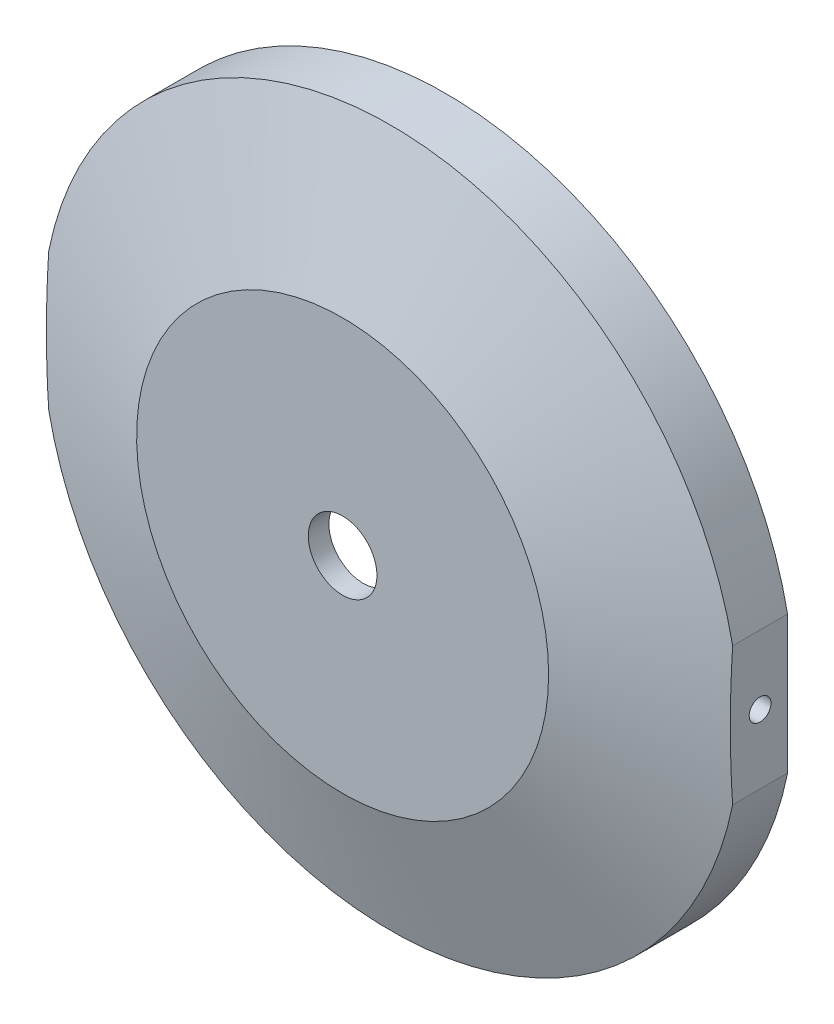
ISO-10303-21;
HEADER;
FILE_DESCRIPTION(('STEP AP214'),'2;1');
FILE_NAME('part.step','',(''),(''),'','','');
FILE_SCHEMA(('AUTOMOTIVE_DESIGN { 1 0 10303 214 1 1 1 1 }'));
ENDSEC;
DATA;
#1=APPLICATION_CONTEXT('core data for automotive mechanical design processes');
#2=APPLICATION_PROTOCOL_DEFINITION('international standard','automotive_design',2000,#1);
#3=PRODUCT_CONTEXT('',#1,'mechanical');
#4=PRODUCT('Part','Part','',(#3));
#5=PRODUCT_RELATED_PRODUCT_CATEGORY('part','',(#4));
#6=PRODUCT_DEFINITION_FORMATION('','',#4);
#7=PRODUCT_DEFINITION_CONTEXT('part definition',#1,'design');
#8=PRODUCT_DEFINITION('design','',#6,#7);
#9=PRODUCT_DEFINITION_SHAPE('','',#8);
#10=(LENGTH_UNIT() NAMED_UNIT(*) SI_UNIT(.MILLI.,.METRE.));
#11=(NAMED_UNIT(*) PLANE_ANGLE_UNIT() SI_UNIT($,.RADIAN.));
#12=(NAMED_UNIT(*) SI_UNIT($,.STERADIAN.) SOLID_ANGLE_UNIT());
#13=UNCERTAINTY_MEASURE_WITH_UNIT(LENGTH_MEASURE(1.E-05),#10,'distance_accuracy_value','');
#14=(GEOMETRIC_REPRESENTATION_CONTEXT(3) GLOBAL_UNCERTAINTY_ASSIGNED_CONTEXT((#13)) GLOBAL_UNIT_ASSIGNED_CONTEXT((#10,
#11,#12)) REPRESENTATION_CONTEXT('',''));
#15=CARTESIAN_POINT('',(0.,0.,0.));
#16=DIRECTION('',(0.,0.,1.));
#17=DIRECTION('',(1.,0.,0.));
#18=AXIS2_PLACEMENT_3D('',#15,#16,#17);
#19=CARTESIAN_POINT('',(-49.8,0.,0.));
#20=DIRECTION('',(1.,0.,0.));
#21=DIRECTION('',(0.,0.,1.));
#22=AXIS2_PLACEMENT_3D('',#19,#20,#21);
#23=PLANE('',#22);
#24=CARTESIAN_POINT('',(-49.8,-38.4617099714943,-11.0799606111375));
#25=CARTESIAN_POINT('',(-49.8,-37.1028634271938,-10.8004756503426));
#26=CARTESIAN_POINT('',(-49.8,-35.7421612624027,-10.5298064962957));
#27=CARTESIAN_POINT('',(-49.8,-33.0167625762512,-10.0087030148906));
#28=CARTESIAN_POINT('',(-49.8,-31.6520656935223,-9.75827058072604));
#29=CARTESIAN_POINT('',(-49.8,-28.9172889925232,-9.28005926574882));
#30=CARTESIAN_POINT('',(-49.8,-27.5472051703253,-9.0523031643991));
#31=CARTESIAN_POINT('',(-49.8,-24.8030093164406,-8.62262887703947));
#32=CARTESIAN_POINT('',(-49.8,-23.4288973847371,-8.42071005517551));
#33=CARTESIAN_POINT('',(-49.8,-20.6784717869354,-8.04592394670637));
#34=CARTESIAN_POINT('',(-49.8,-19.3021631243411,-7.87302013548836));
#35=CARTESIAN_POINT('',(-49.8,-16.5459073872997,-7.5588924160293));
#36=CARTESIAN_POINT('',(-49.8,-15.1659602964614,-7.417668650754));
#37=CARTESIAN_POINT('',(-49.8,-12.4034646218349,-7.16966287483199));
#38=CARTESIAN_POINT('',(-49.8,-11.0209171780662,-7.06286824870942));
#39=CARTESIAN_POINT('',(-49.8,-8.25346962181492,-6.8859203200606));
#40=CARTESIAN_POINT('',(-49.8,-6.86856952262751,-6.81576681115775));
#41=CARTESIAN_POINT('',(-49.8,-4.12180458675857,-6.71460368668181));
#42=CARTESIAN_POINT('',(-49.8,-2.75996452600506,-6.68292514818495));
#43=CARTESIAN_POINT('',(-49.8,-0.0359268590491195,-6.65720177420516));
#44=CARTESIAN_POINT('',(-49.8,1.32627074688356,-6.6631569104102));
#45=CARTESIAN_POINT('',(-49.8,4.05016431956752,-6.71256597927004));
#46=CARTESIAN_POINT('',(-49.8,5.41186019410504,-6.75602495975847));
#47=CARTESIAN_POINT('',(-49.8,8.13358342299819,-6.87945660113571));
#48=CARTESIAN_POINT('',(-49.8,9.49361077608038,-6.95942928987478));
#49=CARTESIAN_POINT('',(-49.8,12.2103226888578,-7.15409767239459));
#50=CARTESIAN_POINT('',(-49.8,13.5670087946878,-7.26877188277581));
#51=CARTESIAN_POINT('',(-49.8,16.2772138130531,-7.53056683958318));
#52=CARTESIAN_POINT('',(-49.8,17.630732702847,-7.6776878182677));
#53=CARTESIAN_POINT('',(-49.8,21.6856351084796,-8.16374002143987));
#54=CARTESIAN_POINT('',(-49.8,24.3817590338531,-8.54739025310277));
#55=CARTESIAN_POINT('',(-49.8,28.0213916738615,-9.13235604065327));
#56=CARTESIAN_POINT('',(-49.8,28.9720256030184,-9.29136935083275));
#57=CARTESIAN_POINT('',(-49.8,30.8711995955897,-9.62054500946501));
#58=CARTESIAN_POINT('',(-49.8,31.8197400154546,-9.79070527947151));
#59=CARTESIAN_POINT('',(-49.8,33.7182002084387,-10.1418873244519));
#60=CARTESIAN_POINT('',(-49.8,34.6681133563194,-10.3229447219384));
#61=CARTESIAN_POINT('',(-49.8,36.5662185298103,-10.6945521658018));
#62=CARTESIAN_POINT('',(-49.8,37.5144103000147,-10.8851035177669));
#63=CARTESIAN_POINT('',(-49.8,38.4617099714943,-11.0799606111375));
#64=B_SPLINE_CURVE_WITH_KNOTS('',3,(#24,#25,#26,#27,#28,#29,#30,#31,#32,#33,#34,#35,#36,#37,#38,
#39,#40,#41,#42,#43,#44,#45,#46,#47,#48,#49,#50,#51,#52,#53,#54,#55,#56,#57,#58,#59,#60,#61,#62,
#63),.UNSPECIFIED.,.F.,.F.,(4,2,2,2,2,2,2,2,2,2,2,2,2,2,2,2,2,2,2,4),(0.,4.16190504640935,
8.32419899932475,12.4906328603568,16.6569641659464,20.8180108238715,24.9790762593968,
29.1386152657589,33.2981308437747,37.38424372195,41.4703535261184,45.5570133864311,
49.6436763637838,53.7278144830035,57.8119818379883,65.9791302545674,68.8706379270792,
71.7616079793714,74.6626043144856,77.5640006954821),.UNSPECIFIED.);
#65=CARTESIAN_POINT('',(-49.8,-10.0299551344959,-6.9999999999999));
#66=VERTEX_POINT('',#65);
#67=CARTESIAN_POINT('',(-49.8,10.0299551344959,-6.9999999999999));
#68=VERTEX_POINT('',#67);
#69=EDGE_CURVE('E147',#66,#68,#64,.T.);
#70=ORIENTED_EDGE('',*,*,#69,.T.);
#71=DIRECTION('',(0.,0.,1.));
#72=VECTOR('',#71,1.);
#73=CARTESIAN_POINT('',(-49.8,10.0299551344959,1000.));
#74=LINE('',#73,#72);
#75=CARTESIAN_POINT('',(-49.8,10.0299551344959,-14.9999999999999));
#76=VERTEX_POINT('',#75);
#77=EDGE_CURVE('E55',#76,#68,#74,.T.);
#78=ORIENTED_EDGE('',*,*,#77,.F.);
#79=DIRECTION('',(0.,1.,0.));
#80=VECTOR('',#79,1.);
#81=CARTESIAN_POINT('',(-49.8,0.,-15.));
#82=LINE('',#81,#80);
#83=CARTESIAN_POINT('',(-49.8,-10.0299551344959,-14.9999999999999));
#84=VERTEX_POINT('',#83);
#85=EDGE_CURVE('E11',#84,#76,#82,.T.);
#86=ORIENTED_EDGE('',*,*,#85,.F.);
#87=DIRECTION('',(0.,0.,1.));
#88=VECTOR('',#87,1.);
#89=CARTESIAN_POINT('',(-49.8,-10.0299551344959,1000.));
#90=LINE('',#89,#88);
#91=EDGE_CURVE('E80',#66,#84,#90,.F.);
#92=ORIENTED_EDGE('',*,*,#91,.F.);
#93=EDGE_LOOP('',(#70,#78,#86,#92));
#94=FACE_BOUND('',#93,.T.);
#95=CARTESIAN_POINT('',(-49.8,0.,-10.9999999999999));
#96=DIRECTION('',(-1.,0.,0.));
#97=DIRECTION('',(0.,0.,1.));
#98=AXIS2_PLACEMENT_3D('',#95,#96,#97);
#99=CIRCLE('',#98,1.5875);
#100=CARTESIAN_POINT('',(-49.8,0.,-9.41249999999994));
#101=VERTEX_POINT('',#100);
#102=EDGE_CURVE('E333',#101,#101,#99,.T.);
#103=ORIENTED_EDGE('',*,*,#102,.F.);
#104=EDGE_LOOP('',(#103));
#105=FACE_BOUND('',#104,.T.);
#106=ADVANCED_FACE('F39',(#94,#105),#23,.F.);
#107=CARTESIAN_POINT('',(0.,0.,1000.));
#108=DIRECTION('',(0.,0.,1.));
#109=DIRECTION('',(1.,0.,0.));
#110=AXIS2_PLACEMENT_3D('',#107,#108,#109);
#111=CYLINDRICAL_SURFACE('',#110,50.8);
#112=CARTESIAN_POINT('',(0.,0.,-6.9999999999999));
#113=DIRECTION('',(0.,0.,1.));
#114=DIRECTION('',(1.,0.,0.));
#115=AXIS2_PLACEMENT_3D('',#112,#113,#114);
#116=CIRCLE('',#115,50.8);
#117=CARTESIAN_POINT('',(49.8,-10.0299551344959,-6.9999999999999));
#118=VERTEX_POINT('',#117);
#119=EDGE_CURVE('E87',#66,#118,#116,.T.);
#120=ORIENTED_EDGE('',*,*,#119,.F.);
#121=ORIENTED_EDGE('',*,*,#91,.T.);
#122=CARTESIAN_POINT('',(0.,0.,-14.9999999999999));
#123=DIRECTION('',(0.,0.,1.));
#124=DIRECTION('',(1.,0.,0.));
#125=AXIS2_PLACEMENT_3D('',#122,#123,#124);
#126=CIRCLE('',#125,50.8);
#127=CARTESIAN_POINT('',(49.8,-10.0299551344959,-14.9999999999999));
#128=VERTEX_POINT('',#127);
#129=EDGE_CURVE('E62',#84,#128,#126,.T.);
#130=ORIENTED_EDGE('',*,*,#129,.T.);
#131=DIRECTION('',(0.,0.,1.));
#132=VECTOR('',#131,1.);
#133=CARTESIAN_POINT('',(49.8,-10.0299551344959,1000.));
#134=LINE('',#133,#132);
#135=EDGE_CURVE('E173',#128,#118,#134,.T.);
#136=ORIENTED_EDGE('',*,*,#135,.T.);
#137=EDGE_LOOP('',(#120,#121,#130,#136));
#138=FACE_BOUND('',#137,.T.);
#139=ADVANCED_FACE('F86',(#138),#111,.T.);
#140=CARTESIAN_POINT('',(49.8,0.,0.));
#141=DIRECTION('',(-1.,0.,0.));
#142=DIRECTION('',(0.,0.,1.));
#143=AXIS2_PLACEMENT_3D('',#140,#141,#142);
#144=PLANE('',#143);
#145=CARTESIAN_POINT('',(49.8,38.4617099714943,-11.0799606111375));
#146=CARTESIAN_POINT('',(49.8,37.1028634271938,-10.8004756503426));
#147=CARTESIAN_POINT('',(49.8,35.7421612624027,-10.5298064962957));
#148=CARTESIAN_POINT('',(49.8,33.0167625762512,-10.0087030148906));
#149=CARTESIAN_POINT('',(49.8,31.6520656935223,-9.75827058072603));
#150=CARTESIAN_POINT('',(49.8,28.9172889925232,-9.28005926574882));
#151=CARTESIAN_POINT('',(49.8,27.5472051703253,-9.0523031643991));
#152=CARTESIAN_POINT('',(49.8,24.8030093164406,-8.62262887703947));
#153=CARTESIAN_POINT('',(49.8,23.428897384737,-8.4207100551755));
#154=CARTESIAN_POINT('',(49.8,20.6784717869354,-8.04592394670637));
#155=CARTESIAN_POINT('',(49.8,19.3021631243411,-7.87302013548836));
#156=CARTESIAN_POINT('',(49.8,16.5459073872996,-7.55889241602929));
#157=CARTESIAN_POINT('',(49.8,15.1659602964613,-7.417668650754));
#158=CARTESIAN_POINT('',(49.8,12.4034646218349,-7.16966287483199));
#159=CARTESIAN_POINT('',(49.8,11.0209171780662,-7.06286824870942));
#160=CARTESIAN_POINT('',(49.8,8.25346962181491,-6.8859203200606));
#161=CARTESIAN_POINT('',(49.8,6.8685695226275,-6.81576681115775));
#162=CARTESIAN_POINT('',(49.8,4.12180458675857,-6.71460368668181));
#163=CARTESIAN_POINT('',(49.8,2.75996452600506,-6.68292514818495));
#164=CARTESIAN_POINT('',(49.8,0.0359268590491145,-6.65720177420516));
#165=CARTESIAN_POINT('',(49.8,-1.32627074688356,-6.6631569104102));
#166=CARTESIAN_POINT('',(49.8,-4.05016431956752,-6.71256597927004));
#167=CARTESIAN_POINT('',(49.8,-5.41186019410504,-6.75602495975847));
#168=CARTESIAN_POINT('',(49.8,-8.13358342299819,-6.87945660113571));
#169=CARTESIAN_POINT('',(49.8,-9.49361077608038,-6.95942928987478));
#170=CARTESIAN_POINT('',(49.8,-12.2103226888578,-7.15409767239459));
#171=CARTESIAN_POINT('',(49.8,-13.5670087946878,-7.26877188277581));
#172=CARTESIAN_POINT('',(49.8,-16.2772138130531,-7.53056683958318));
#173=CARTESIAN_POINT('',(49.8,-17.630732702847,-7.6776878182677));
#174=CARTESIAN_POINT('',(49.8,-21.6856351084796,-8.16374002143987));
#175=CARTESIAN_POINT('',(49.8,-24.3817590338531,-8.54739025310277));
#176=CARTESIAN_POINT('',(49.8,-28.0213916738615,-9.13235604065327));
#177=CARTESIAN_POINT('',(49.8,-28.9720256030184,-9.29136935083275));
#178=CARTESIAN_POINT('',(49.8,-30.8711995955897,-9.62054500946502));
#179=CARTESIAN_POINT('',(49.8,-31.8197400154546,-9.79070527947151));
#180=CARTESIAN_POINT('',(49.8,-33.7182002084387,-10.1418873244519));
#181=CARTESIAN_POINT('',(49.8,-34.6681133563194,-10.3229447219384));
#182=CARTESIAN_POINT('',(49.8,-36.5662185298103,-10.6945521658018));
#183=CARTESIAN_POINT('',(49.8,-37.5144103000147,-10.8851035177669));
#184=CARTESIAN_POINT('',(49.8,-38.4617099714943,-11.0799606111375));
#185=B_SPLINE_CURVE_WITH_KNOTS('',3,(#145,#146,#147,#148,#149,#150,#151,#152,#153,#154,#155,
#156,#157,#158,#159,#160,#161,#162,#163,#164,#165,#166,#167,#168,#169,#170,#171,#172,#173,#174,
#175,#176,#177,#178,#179,#180,#181,#182,#183,#184),.UNSPECIFIED.,.F.,.F.,(4,2,2,2,2,2,2,2,2,2,2,
2,2,2,2,2,2,2,2,4),(0.,4.16190504640937,8.32419899932476,12.4906328603568,16.6569641659464,
20.8180108238716,24.9790762593968,29.1386152657589,33.2981308437748,37.38424372195,
41.4703535261184,45.5570133864311,49.6436763637839,53.7278144830035,57.8119818379883,
65.9791302545674,68.8706379270792,71.7616079793714,74.6626043144856,77.5640006954821),.UNSPECIFIED.);
#186=CARTESIAN_POINT('',(49.8,10.0299551344959,-6.9999999999999));
#187=VERTEX_POINT('',#186);
#188=EDGE_CURVE('E167',#187,#118,#185,.T.);
#189=ORIENTED_EDGE('',*,*,#188,.T.);
#190=ORIENTED_EDGE('',*,*,#135,.F.);
#191=DIRECTION('',(0.,-1.,0.));
#192=VECTOR('',#191,1.);
#193=CARTESIAN_POINT('',(49.8,0.,-15.));
#194=LINE('',#193,#192);
#195=CARTESIAN_POINT('',(49.8,10.0299551344959,-14.9999999999999));
#196=VERTEX_POINT('',#195);
#197=EDGE_CURVE('E48',#196,#128,#194,.T.);
#198=ORIENTED_EDGE('',*,*,#197,.F.);
#199=DIRECTION('',(0.,0.,1.));
#200=VECTOR('',#199,1.);
#201=CARTESIAN_POINT('',(49.8,10.0299551344959,1000.));
#202=LINE('',#201,#200);
#203=EDGE_CURVE('E163',#187,#196,#202,.F.);
#204=ORIENTED_EDGE('',*,*,#203,.F.);
#205=EDGE_LOOP('',(#189,#190,#198,#204));
#206=FACE_BOUND('',#205,.T.);
#207=CARTESIAN_POINT('',(49.8,0.,-10.9999999999999));
#208=DIRECTION('',(1.,0.,0.));
#209=DIRECTION('',(0.,0.,-1.));
#210=AXIS2_PLACEMENT_3D('',#207,#208,#209);
#211=CIRCLE('',#210,1.5875);
#212=CARTESIAN_POINT('',(49.8,0.,-12.5874999999999));
#213=VERTEX_POINT('',#212);
#214=EDGE_CURVE('E154',#213,#213,#211,.T.);
#215=ORIENTED_EDGE('',*,*,#214,.F.);
#216=EDGE_LOOP('',(#215));
#217=FACE_BOUND('',#216,.T.);
#218=ADVANCED_FACE('F121',(#206,#217),#144,.F.);
#219=EDGE_CURVE('E93',#196,#76,#126,.T.);
#220=ORIENTED_EDGE('',*,*,#219,.T.);
#221=ORIENTED_EDGE('',*,*,#77,.T.);
#222=EDGE_CURVE('E94',#187,#68,#116,.T.);
#223=ORIENTED_EDGE('',*,*,#222,.F.);
#224=ORIENTED_EDGE('',*,*,#203,.T.);
#225=EDGE_LOOP('',(#220,#221,#223,#224));
#226=FACE_BOUND('',#225,.T.);
#227=ADVANCED_FACE('F119',(#226),#111,.T.);
#228=CARTESIAN_POINT('',(0.,0.,0.));
#229=DIRECTION('',(0.,0.,-1.));
#230=DIRECTION('',(-1.,0.,0.));
#231=AXIS2_PLACEMENT_3D('',#228,#229,#230);
#232=CONICAL_SURFACE('',#231,30.,1.24616393599575);
#233=ORIENTED_EDGE('',*,*,#69,.F.);
#234=ORIENTED_EDGE('',*,*,#119,.T.);
#235=ORIENTED_EDGE('',*,*,#188,.F.);
#236=ORIENTED_EDGE('',*,*,#222,.T.);
#237=EDGE_LOOP('',(#233,#234,#235,#236));
#238=FACE_BOUND('',#237,.T.);
#239=CARTESIAN_POINT('',(0.,0.,0.));
#240=DIRECTION('',(0.,0.,1.));
#241=DIRECTION('',(1.,0.,0.));
#242=AXIS2_PLACEMENT_3D('',#239,#240,#241);
#243=CIRCLE('',#242,30.);
#244=CARTESIAN_POINT('',(30.,0.,0.));
#245=VERTEX_POINT('',#244);
#246=EDGE_CURVE('E112',#245,#245,#243,.T.);
#247=ORIENTED_EDGE('',*,*,#246,.F.);
#248=EDGE_LOOP('',(#247));
#249=FACE_BOUND('',#248,.T.);
#250=ADVANCED_FACE('F41',(#238,#249),#232,.T.);
#251=CARTESIAN_POINT('',(0.,0.,-15.));
#252=DIRECTION('',(0.,0.,1.));
#253=DIRECTION('',(1.,0.,0.));
#254=AXIS2_PLACEMENT_3D('',#251,#252,#253);
#255=PLANE('',#254);
#256=ORIENTED_EDGE('',*,*,#129,.F.);
#257=ORIENTED_EDGE('',*,*,#85,.T.);
#258=ORIENTED_EDGE('',*,*,#219,.F.);
#259=ORIENTED_EDGE('',*,*,#197,.T.);
#260=EDGE_LOOP('',(#256,#257,#258,#259));
#261=FACE_BOUND('',#260,.T.);
#262=CARTESIAN_POINT('',(0.,0.,-14.9999999999999));
#263=DIRECTION('',(0.,0.,1.));
#264=DIRECTION('',(1.,0.,0.));
#265=AXIS2_PLACEMENT_3D('',#262,#263,#264);
#266=CIRCLE('',#265,40.8);
#267=CARTESIAN_POINT('',(40.8,0.,-14.9999999999999));
#268=VERTEX_POINT('',#267);
#269=EDGE_CURVE('E96',#268,#268,#266,.T.);
#270=ORIENTED_EDGE('',*,*,#269,.T.);
#271=EDGE_LOOP('',(#270));
#272=FACE_BOUND('',#271,.T.);
#273=ADVANCED_FACE('F91',(#261,#272),#255,.F.);
#274=CARTESIAN_POINT('',(0.,0.,-2.99999999999989));
#275=DIRECTION('',(0.,0.,-1.));
#276=DIRECTION('',(-1.,0.,0.));
#277=AXIS2_PLACEMENT_3D('',#274,#275,#276);
#278=CONICAL_SURFACE('',#277,30.,0.732815101786506);
#279=CARTESIAN_POINT('',(-38.4199338147329,-0.810544965095383,-12.3649809923855));
#280=CARTESIAN_POINT('',(-38.3730539071341,-0.894911242400373,-12.3148807931537));
#281=CARTESIAN_POINT('',(-38.3202763904242,-0.972226663788445,-12.2583789476594));
#282=CARTESIAN_POINT('',(-38.2065859614311,-1.11246060110162,-12.1363453045319));
#283=CARTESIAN_POINT('',(-38.1456500373352,-1.17533697544706,-12.0707879474654));
#284=CARTESIAN_POINT('',(-38.0016673903235,-1.30177796307235,-11.9154300192634));
#285=CARTESIAN_POINT('',(-37.9170086284632,-1.36121304035351,-11.8237758943185));
#286=CARTESIAN_POINT('',(-37.7428002766893,-1.45913296765014,-11.634398788922));
#287=CARTESIAN_POINT('',(-37.6532498819745,-1.49761435874483,-11.5366748094561));
#288=CARTESIAN_POINT('',(-37.4701772804456,-1.5550942285889,-11.336021154305));
#289=CARTESIAN_POINT('',(-37.3766131421434,-1.57374364186858,-11.2330306246421));
#290=CARTESIAN_POINT('',(-37.1890685511408,-1.59070219537753,-11.0256343147074));
#291=CARTESIAN_POINT('',(-37.0950878031807,-1.58899331147482,-10.9212273620962));
#292=CARTESIAN_POINT('',(-36.8949853254557,-1.56311375983954,-10.6978673692091));
#293=CARTESIAN_POINT('',(-36.7891208423954,-1.53566241162674,-10.5790438030872));
#294=CARTESIAN_POINT('',(-36.5831336302766,-1.45203462692752,-10.3465765965692));
#295=CARTESIAN_POINT('',(-36.4830014833372,-1.39590690351057,-10.2329245266706));
#296=CARTESIAN_POINT('',(-36.3265465120398,-1.27795663715601,-10.0544362410346));
#297=CARTESIAN_POINT('',(-36.2671435202667,-1.22498049034809,-9.98642154114552));
#298=CARTESIAN_POINT('',(-36.1547416831258,-1.10551275581503,-9.85732562072716));
#299=CARTESIAN_POINT('',(-36.1017319855191,-1.03904459975294,-9.79623266194785));
#300=CARTESIAN_POINT('',(-36.0142610102751,-0.90718940835452,-9.69515486549662));
#301=CARTESIAN_POINT('',(-35.978208953858,-0.844230492439008,-9.65339026144351));
#302=CARTESIAN_POINT('',(-35.9133268913811,-0.710102319940349,-9.57809488127499));
#303=CARTESIAN_POINT('',(-35.8844947916242,-0.63893545232421,-9.54456171820058));
#304=CARTESIAN_POINT('',(-35.8355314621843,-0.488995712802122,-9.4875439651493));
#305=CARTESIAN_POINT('',(-35.8154809210956,-0.410160120255612,-9.46415258092759));
#306=CARTESIAN_POINT('',(-35.7860491332657,-0.247922526165368,-9.42979650382352));
#307=CARTESIAN_POINT('',(-35.7766555920876,-0.164525903165688,-9.41881749147215));
#308=CARTESIAN_POINT('',(-35.769889745479,-0.00911424175784754,-9.41091029084619));
#309=CARTESIAN_POINT('',(-35.770935196198,0.062745710864569,-9.41213271230035));
#310=CARTESIAN_POINT('',(-35.7812455949651,0.205043322297925,-9.4241805087807));
#311=CARTESIAN_POINT('',(-35.7905093705543,0.275481182524241,-9.43500451400668));
#312=CARTESIAN_POINT('',(-35.8160927639787,0.409956309150205,-9.46486504550116));
#313=CARTESIAN_POINT('',(-35.8320948032056,0.474138422573501,-9.48353185626534));
#314=CARTESIAN_POINT('',(-35.8702461370634,0.59802577114378,-9.52797538929523));
#315=CARTESIAN_POINT('',(-35.8923966170738,0.657730140188506,-9.55375348256421));
#316=CARTESIAN_POINT('',(-35.9445929095443,0.777991816297565,-9.61439637707532));
#317=CARTESIAN_POINT('',(-35.9752330669632,0.837944801469034,-9.649941880958));
#318=CARTESIAN_POINT('',(-36.0416946103133,0.950784508327184,-9.72687827968761));
#319=CARTESIAN_POINT('',(-36.0775197490002,1.00366605809396,-9.76827340782484));
#320=CARTESIAN_POINT('',(-36.1728709187592,1.127680748937,-9.87818901326298));
#321=CARTESIAN_POINT('',(-36.2350831418123,1.19413852102941,-9.94967881689967));
#322=CARTESIAN_POINT('',(-36.3660408842828,1.31089911494595,-10.0995747678933));
#323=CARTESIAN_POINT('',(-36.4348005296956,1.36116593271146,-10.17799584199));
#324=CARTESIAN_POINT('',(-36.5963710135811,1.45809974236915,-10.3615232881246));
#325=CARTESIAN_POINT('',(-36.6905585326746,1.49989111639571,-10.4679928113748));
#326=CARTESIAN_POINT('',(-36.882688442245,1.55978161001273,-10.6840521036295));
#327=CARTESIAN_POINT('',(-36.9806331931524,1.57786557628269,-10.7936438226084));
#328=CARTESIAN_POINT('',(-37.1789244520599,1.59132698726595,-11.0144052149423));
#329=CARTESIAN_POINT('',(-37.2792856760725,1.58642979881935,-11.1255780629267));
#330=CARTESIAN_POINT('',(-37.4788199179699,1.55342131933858,-11.3455482021717));
#331=CARTESIAN_POINT('',(-37.5779932364229,1.52531603199366,-11.4543461003362));
#332=CARTESIAN_POINT('',(-37.7594930097679,1.45051289310001,-11.6525824212507));
#333=CARTESIAN_POINT('',(-37.842313828561,1.40676293495481,-11.7426791694524));
#334=CARTESIAN_POINT('',(-38.0025130220679,1.30031327737421,-11.9163456752868));
#335=CARTESIAN_POINT('',(-38.0798986249133,1.23763935592518,-11.9999241184122));
#336=CARTESIAN_POINT('',(-38.206317901462,1.11162439198525,-12.136051990917));
#337=CARTESIAN_POINT('',(-38.2574191973213,1.05289136503324,-12.1909430388102));
#338=CARTESIAN_POINT('',(-38.3528192571324,0.92436457779356,-12.2932236207843));
#339=CARTESIAN_POINT('',(-38.3971278088135,0.854587032221202,-12.3406239514069));
#340=CARTESIAN_POINT('',(-38.468307959408,0.719684639579292,-12.416657961918));
#341=CARTESIAN_POINT('',(-38.4968926539472,0.65651811172298,-12.4471473386075));
#342=CARTESIAN_POINT('',(-38.5466399129662,0.524155449048179,-12.5001624442233));
#343=CARTESIAN_POINT('',(-38.567806837555,0.454962886252694,-12.5226928514341));
#344=CARTESIAN_POINT('',(-38.6013725680604,0.311507733379799,-12.5584024095634));
#345=CARTESIAN_POINT('',(-38.6137023568709,0.237210097547755,-12.5715079559262));
#346=CARTESIAN_POINT('',(-38.628225204494,0.0865358748974197,-12.586943177822));
#347=CARTESIAN_POINT('',(-38.6304253399521,0.010160776941284,-12.5892803761978));
#348=CARTESIAN_POINT('',(-38.6248814109792,-0.132147988514036,-12.5833890760631));
#349=CARTESIAN_POINT('',(-38.6183499142613,-0.198189849953574,-12.5764489358125));
#350=CARTESIAN_POINT('',(-38.5978799062161,-0.327758795978292,-12.5546855266851));
#351=CARTESIAN_POINT('',(-38.5839405736373,-0.391285600898679,-12.5398613837676));
#352=CARTESIAN_POINT('',(-38.5486716962099,-0.517426043018046,-12.5023217920106));
#353=CARTESIAN_POINT('',(-38.5270117582082,-0.579840337205424,-12.4792534010887));
#354=CARTESIAN_POINT('',(-38.4776920425637,-0.699322439553563,-12.426666006635));
#355=CARTESIAN_POINT('',(-38.4500281092512,-0.756386505177755,-12.397142535109));
#356=CARTESIAN_POINT('',(-38.4199338147329,-0.810544965095383,-12.3649809923855));
#357=B_SPLINE_CURVE_WITH_KNOTS('',3,(#279,#280,#281,#282,#283,#284,#285,#286,#287,#288,#289,
#290,#291,#292,#293,#294,#295,#296,#297,#298,#299,#300,#301,#302,#303,#304,#305,#306,#307,#308,
#309,#310,#311,#312,#313,#314,#315,#316,#317,#318,#319,#320,#321,#322,#323,#324,#325,#326,#327,
#328,#329,#330,#331,#332,#333,#334,#335,#336,#337,#338,#339,#340,#341,#342,#343,#344,#345,#346,
#347,#348,#349,#350,#351,#352,#353,#354,#355,#356),.UNSPECIFIED.,.T.,.F.,(4,2,2,2,2,2,2,2,2,2,2,
2,2,2,2,2,2,2,2,2,2,2,2,2,2,2,2,2,2,2,2,2,2,2,2,2,2,2,4),(0.,0.325910999094959,
0.652761438858572,1.06518353464625,1.47767369021207,1.89730971473154,2.31731728981369,
2.79936677071602,3.28060009479941,3.59364193017349,3.90614468500834,4.15632336599026,
4.40642941405484,4.65878764711123,4.91085445035865,5.12537352949237,5.33986200940082,
5.54520813477187,5.75059387707579,5.97816208855158,6.2058958394456,6.55122267441872,
6.89731219950263,7.33950535515032,7.78198101460067,8.22975779276774,8.67741877210226,
9.0659202190116,9.45389482347444,9.73871376304504,10.0231183669056,10.249461373346,
10.4756711130472,10.7036288263848,10.9314272627067,11.1306558332043,11.3299064952993,
11.5389780654073,11.7481948086967),.UNSPECIFIED.);
#358=CARTESIAN_POINT('',(-38.4199338147329,-0.810544965095383,-12.3649809923855));
#359=VERTEX_POINT('',#358);
#360=EDGE_CURVE('E88',#359,#359,#357,.T.);
#361=ORIENTED_EDGE('',*,*,#360,.T.);
#362=EDGE_LOOP('',(#361));
#363=FACE_BOUND('',#362,.T.);
#364=CARTESIAN_POINT('',(35.8824665684172,-0.62844338789335,-9.54218822949831));
#365=CARTESIAN_POINT('',(35.9131868848908,-0.711345618162502,-9.57792966673884));
#366=CARTESIAN_POINT('',(35.9494274845561,-0.789470183015198,-9.62002694275901));
#367=CARTESIAN_POINT('',(36.030462130028,-0.934679053738043,-9.7139020625408));
#368=CARTESIAN_POINT('',(36.0752729492181,-1.00174122109514,-9.76569888575318));
#369=CARTESIAN_POINT('',(36.1817950202165,-1.13787414074138,-9.88845447937822));
#370=CARTESIAN_POINT('',(36.2450585627689,-1.20417109480017,-9.96112583492883));
#371=CARTESIAN_POINT('',(36.3780496776666,-1.32025638768579,-10.1132857013372));
#372=CARTESIAN_POINT('',(36.4477838583966,-1.37002760617967,-10.1927811752431));
#373=CARTESIAN_POINT('',(36.6111521587458,-1.4653411565175,-10.3782563846966));
#374=CARTESIAN_POINT('',(36.7061205468833,-1.50603470129794,-10.4855497280853));
#375=CARTESIAN_POINT('',(36.8997215755735,-1.56355802306364,-10.7031392756454));
#376=CARTESIAN_POINT('',(36.9983574332577,-1.58036631553733,-10.8134380924505));
#377=CARTESIAN_POINT('',(37.197848410776,-1.59103341579529,-11.0353987445761));
#378=CARTESIAN_POINT('',(37.2987160107041,-1.58462784792252,-11.1470617558132));
#379=CARTESIAN_POINT('',(37.4990753627587,-1.54834859062816,-11.3678009821954));
#380=CARTESIAN_POINT('',(37.5985676054153,-1.5184835000789,-11.4768781300764));
#381=CARTESIAN_POINT('',(37.779028716651,-1.44069169162742,-11.6738544249527));
#382=CARTESIAN_POINT('',(37.8605779458295,-1.39604688605977,-11.7625171505805));
#383=CARTESIAN_POINT('',(38.0181552320355,-1.288162603261,-11.9332553793883));
#384=CARTESIAN_POINT('',(38.0941907498575,-1.22494886066846,-12.0153398003486));
#385=CARTESIAN_POINT('',(38.2183441427659,-1.09822557979171,-12.1489780844438));
#386=CARTESIAN_POINT('',(38.2685294665998,-1.03920933012267,-12.2028674580779));
#387=CARTESIAN_POINT('',(38.3620635787272,-0.910318328977971,-12.3031187673269));
#388=CARTESIAN_POINT('',(38.405422093938,-0.840459313660304,-12.3494914156928));
#389=CARTESIAN_POINT('',(38.4749793841821,-0.705473372357542,-12.4237767847409));
#390=CARTESIAN_POINT('',(38.5028752425386,-0.642239989391924,-12.4535262340562));
#391=CARTESIAN_POINT('',(38.5512322635213,-0.509904946027459,-12.5050523201001));
#392=CARTESIAN_POINT('',(38.5716978883133,-0.440806838507611,-12.526833742022));
#393=CARTESIAN_POINT('',(38.6038828211418,-0.297750849916254,-12.561071331378));
#394=CARTESIAN_POINT('',(38.6155356598362,-0.223760525305139,-12.5734566318879));
#395=CARTESIAN_POINT('',(38.6288063741705,-0.073888769806138,-12.5875605956677));
#396=CARTESIAN_POINT('',(38.6304306202491,0.00199142981290769,-12.5892860303787));
#397=CARTESIAN_POINT('',(38.6239409281449,0.143539051724954,-12.5823896485132));
#398=CARTESIAN_POINT('',(38.6169863360848,0.209327045764947,-12.5749996943298));
#399=CARTESIAN_POINT('',(38.5957446621621,0.338307551141804,-12.5524147886885));
#400=CARTESIAN_POINT('',(38.5814568905769,0.401499817733477,-12.537219103062));
#401=CARTESIAN_POINT('',(38.5460798438499,0.525101601378626,-12.4995615234326));
#402=CARTESIAN_POINT('',(38.5248616122459,0.585431340938833,-12.4769618354467));
#403=CARTESIAN_POINT('',(38.4768111811312,0.701048438611867,-12.425725675154));
#404=CARTESIAN_POINT('',(38.449976150111,0.756333233232806,-12.397086158027));
#405=CARTESIAN_POINT('',(38.3776100155318,0.886924095896012,-12.3197510868558));
#406=CARTESIAN_POINT('',(38.329322564445,0.958940802370422,-12.2680640083828));
#407=CARTESIAN_POINT('',(38.2255812125862,1.09066507649593,-12.1567536916958));
#408=CARTESIAN_POINT('',(38.1701106079075,1.15034308403255,-12.0971119454735));
#409=CARTESIAN_POINT('',(38.0346725594713,1.27580950721159,-11.9511014291077));
#410=CARTESIAN_POINT('',(37.952749028371,1.33688060063922,-11.8624986939561));
#411=CARTESIAN_POINT('',(37.7837518678046,1.43880178478213,-11.67899808506));
#412=CARTESIAN_POINT('',(37.6966750629049,1.4796392592589,-11.5840963254025));
#413=CARTESIAN_POINT('',(37.5180412643632,1.54269703432289,-11.388586749229));
#414=CARTESIAN_POINT('',(37.426429009899,1.56451827577841,-11.2879018191003));
#415=CARTESIAN_POINT('',(37.2424660892093,1.58853002011133,-11.0848064436849));
#416=CARTESIAN_POINT('',(37.150114961696,1.59070711499655,-10.982394867646));
#417=CARTESIAN_POINT('',(36.9514505803454,1.57395712716905,-10.7610623762986));
#418=CARTESIAN_POINT('',(36.8453446684186,1.55149277288907,-10.6422022605067));
#419=CARTESIAN_POINT('',(36.6381215468167,1.47836369922844,-10.4088009912828));
#420=CARTESIAN_POINT('',(36.5369981168743,1.42773516447636,-10.2942544970235));
#421=CARTESIAN_POINT('',(36.375590839901,1.31770803371552,-10.1104741669999));
#422=CARTESIAN_POINT('',(36.3127059242034,1.26649164581334,-10.0386017236026));
#423=CARTESIAN_POINT('',(36.1932336860458,1.14967850395106,-9.90160535537356));
#424=CARTESIAN_POINT('',(36.1366364305497,1.08410493233081,-9.83647079779567));
#425=CARTESIAN_POINT('',(36.0431470746394,0.95353765155354,-9.72857100616269));
#426=CARTESIAN_POINT('',(36.0046036144557,0.891251149375813,-9.68396931956233));
#427=CARTESIAN_POINT('',(35.9347062841598,0.757904692510911,-9.60293096791968));
#428=CARTESIAN_POINT('',(35.9033447224452,0.686854250458449,-9.56648556869387));
#429=CARTESIAN_POINT('',(35.8537271087205,0.548660847954012,-9.50874408478157));
#430=CARTESIAN_POINT('',(35.8341984819078,0.482591312433876,-9.48598151179263));
#431=CARTESIAN_POINT('',(35.8026154049767,0.346352415467378,-9.44914046352048));
#432=CARTESIAN_POINT('',(35.7905569266965,0.276185285962163,-9.43505730801713));
#433=CARTESIAN_POINT('',(35.7746471137815,0.133394057366969,-9.41647166473932));
#434=CARTESIAN_POINT('',(35.7708258737715,0.0607619303209705,-9.41200430822787));
#435=CARTESIAN_POINT('',(35.7717492319254,-0.0843710323662577,-9.41308347089107));
#436=CARTESIAN_POINT('',(35.7764937136613,-0.156871869778611,-9.41862985395574));
#437=CARTESIAN_POINT('',(35.7940858244402,-0.298383126437092,-9.43917841132445));
#438=CARTESIAN_POINT('',(35.8068143066842,-0.367429023068918,-9.45404154775956));
#439=CARTESIAN_POINT('',(35.8394788977458,-0.50136240333287,-9.49213683501212));
#440=CARTESIAN_POINT('',(35.859419191012,-0.56624744696325,-9.51537384450345));
#441=CARTESIAN_POINT('',(35.8824665684172,-0.62844338789335,-9.54218822949831));
#442=B_SPLINE_CURVE_WITH_KNOTS('',3,(#364,#365,#366,#367,#368,#369,#370,#371,#372,#373,#374,
#375,#376,#377,#378,#379,#380,#381,#382,#383,#384,#385,#386,#387,#388,#389,#390,#391,#392,#393,
#394,#395,#396,#397,#398,#399,#400,#401,#402,#403,#404,#405,#406,#407,#408,#409,#410,#411,#412,
#413,#414,#415,#416,#417,#418,#419,#420,#421,#422,#423,#424,#425,#426,#427,#428,#429,#430,#431,
#432,#433,#434,#435,#436,#437,#438,#439,#440,#441),.UNSPECIFIED.,.T.,.F.,(4,2,2,2,2,2,2,2,2,2,2,
2,2,2,2,2,2,2,2,2,2,2,2,2,2,2,2,2,2,2,2,2,2,2,2,2,2,2,4),(0.,0.285745630079688,
0.572056344659446,0.921040951113369,1.27038597875849,1.71493411564308,2.15988186593764,
2.60991283531429,3.05977892690515,3.44382502488813,3.82734136556292,4.10950177732396,
4.39125645274942,4.61610990552375,4.84082810016512,5.06722474995136,5.29347757153377,
5.49223742413957,5.69101597453931,5.89372677233278,6.09654000675085,6.39768936850821,
6.69955204824585,7.10313323084779,7.50696574213274,7.91908169801469,8.33147891986364,
8.81184251661889,9.29159037496251,9.61560098835476,9.93909223485548,10.1954083406146,
10.4514486420144,10.6681994139363,10.8848332043952,11.1022571310688,11.3196781024686,
11.5339292252533,11.7483048611291),.UNSPECIFIED.);
#443=CARTESIAN_POINT('',(35.8824665684172,-0.62844338789335,-9.54218822949831));
#444=VERTEX_POINT('',#443);
#445=EDGE_CURVE('E157',#444,#444,#442,.T.);
#446=ORIENTED_EDGE('',*,*,#445,.T.);
#447=EDGE_LOOP('',(#446));
#448=FACE_BOUND('',#447,.T.);
#449=ORIENTED_EDGE('',*,*,#269,.F.);
#450=EDGE_LOOP('',(#449));
#451=FACE_BOUND('',#450,.T.);
#452=CARTESIAN_POINT('',(0.,0.,-2.99999999999989));
#453=DIRECTION('',(0.,0.,1.));
#454=DIRECTION('',(1.,0.,0.));
#455=AXIS2_PLACEMENT_3D('',#452,#453,#454);
#456=CIRCLE('',#455,30.);
#457=CARTESIAN_POINT('',(30.,0.,-2.99999999999989));
#458=VERTEX_POINT('',#457);
#459=EDGE_CURVE('E103',#458,#458,#456,.T.);
#460=ORIENTED_EDGE('',*,*,#459,.T.);
#461=EDGE_LOOP('',(#460));
#462=FACE_BOUND('',#461,.T.);
#463=ADVANCED_FACE('F126',(#363,#448,#451,#462),#278,.F.);
#464=CARTESIAN_POINT('',(0.,0.,-3.));
#465=DIRECTION('',(0.,0.,1.));
#466=DIRECTION('',(1.,0.,0.));
#467=AXIS2_PLACEMENT_3D('',#464,#465,#466);
#468=PLANE('',#467);
#469=ORIENTED_EDGE('',*,*,#459,.F.);
#470=EDGE_LOOP('',(#469));
#471=FACE_BOUND('',#470,.T.);
#472=CARTESIAN_POINT('',(0.,0.,-2.99999999999989));
#473=DIRECTION('',(0.,0.,1.));
#474=DIRECTION('',(1.,0.,0.));
#475=AXIS2_PLACEMENT_3D('',#472,#473,#474);
#476=CIRCLE('',#475,5.);
#477=CARTESIAN_POINT('',(5.,0.,-2.99999999999989));
#478=VERTEX_POINT('',#477);
#479=EDGE_CURVE('E106',#478,#478,#476,.T.);
#480=ORIENTED_EDGE('',*,*,#479,.T.);
#481=EDGE_LOOP('',(#480));
#482=FACE_BOUND('',#481,.T.);
#483=ADVANCED_FACE('F187',(#471,#482),#468,.F.);
#484=CARTESIAN_POINT('',(0.,0.,1000.));
#485=DIRECTION('',(0.,0.,1.));
#486=DIRECTION('',(1.,0.,0.));
#487=AXIS2_PLACEMENT_3D('',#484,#485,#486);
#488=CYLINDRICAL_SURFACE('',#487,5.);
#489=ORIENTED_EDGE('',*,*,#479,.F.);
#490=EDGE_LOOP('',(#489));
#491=FACE_BOUND('',#490,.T.);
#492=CARTESIAN_POINT('',(0.,0.,0.));
#493=DIRECTION('',(0.,0.,1.));
#494=DIRECTION('',(1.,0.,0.));
#495=AXIS2_PLACEMENT_3D('',#492,#493,#494);
#496=CIRCLE('',#495,5.);
#497=CARTESIAN_POINT('',(5.,0.,0.));
#498=VERTEX_POINT('',#497);
#499=EDGE_CURVE('E109',#498,#498,#496,.T.);
#500=ORIENTED_EDGE('',*,*,#499,.T.);
#501=EDGE_LOOP('',(#500));
#502=FACE_BOUND('',#501,.T.);
#503=ADVANCED_FACE('F196',(#491,#502),#488,.F.);
#504=CARTESIAN_POINT('',(0.,0.,0.));
#505=DIRECTION('',(0.,0.,-1.));
#506=DIRECTION('',(-1.,0.,0.));
#507=AXIS2_PLACEMENT_3D('',#504,#505,#506);
#508=PLANE('',#507);
#509=ORIENTED_EDGE('',*,*,#499,.F.);
#510=EDGE_LOOP('',(#509));
#511=FACE_BOUND('',#510,.T.);
#512=ORIENTED_EDGE('',*,*,#246,.T.);
#513=EDGE_LOOP('',(#512));
#514=FACE_BOUND('',#513,.T.);
#515=ADVANCED_FACE('F116',(#511,#514),#508,.F.);
#516=CARTESIAN_POINT('',(49.8,0.,-10.9999999999999));
#517=DIRECTION('',(1.,0.,0.));
#518=DIRECTION('',(0.,0.,-1.));
#519=AXIS2_PLACEMENT_3D('',#516,#517,#518);
#520=CYLINDRICAL_SURFACE('',#519,1.5875);
#521=ORIENTED_EDGE('',*,*,#214,.T.);
#522=EDGE_LOOP('',(#521));
#523=FACE_BOUND('',#522,.T.);
#524=ORIENTED_EDGE('',*,*,#445,.F.);
#525=EDGE_LOOP('',(#524));
#526=FACE_BOUND('',#525,.T.);
#527=ADVANCED_FACE('F143',(#523,#526),#520,.F.);
#528=CARTESIAN_POINT('',(-49.8,0.,-10.9999999999999));
#529=DIRECTION('',(-1.,0.,0.));
#530=DIRECTION('',(0.,0.,1.));
#531=AXIS2_PLACEMENT_3D('',#528,#529,#530);
#532=CYLINDRICAL_SURFACE('',#531,1.58749999999999);
#533=ORIENTED_EDGE('',*,*,#360,.F.);
#534=EDGE_LOOP('',(#533));
#535=FACE_BOUND('',#534,.T.);
#536=ORIENTED_EDGE('',*,*,#102,.T.);
#537=EDGE_LOOP('',(#536));
#538=FACE_BOUND('',#537,.T.);
#539=ADVANCED_FACE('F182',(#535,#538),#532,.F.);
#540=CLOSED_SHELL('',(#106,#139,#218,#227,#250,#273,#463,#483,#503,#515,#527,#539));
#541=MANIFOLD_SOLID_BREP('B2',#540);
#542=ADVANCED_BREP_SHAPE_REPRESENTATION('',(#18,#541),#14);
#543=SHAPE_DEFINITION_REPRESENTATION(#9,#542);
ENDSEC;
END-ISO-10303-21;
